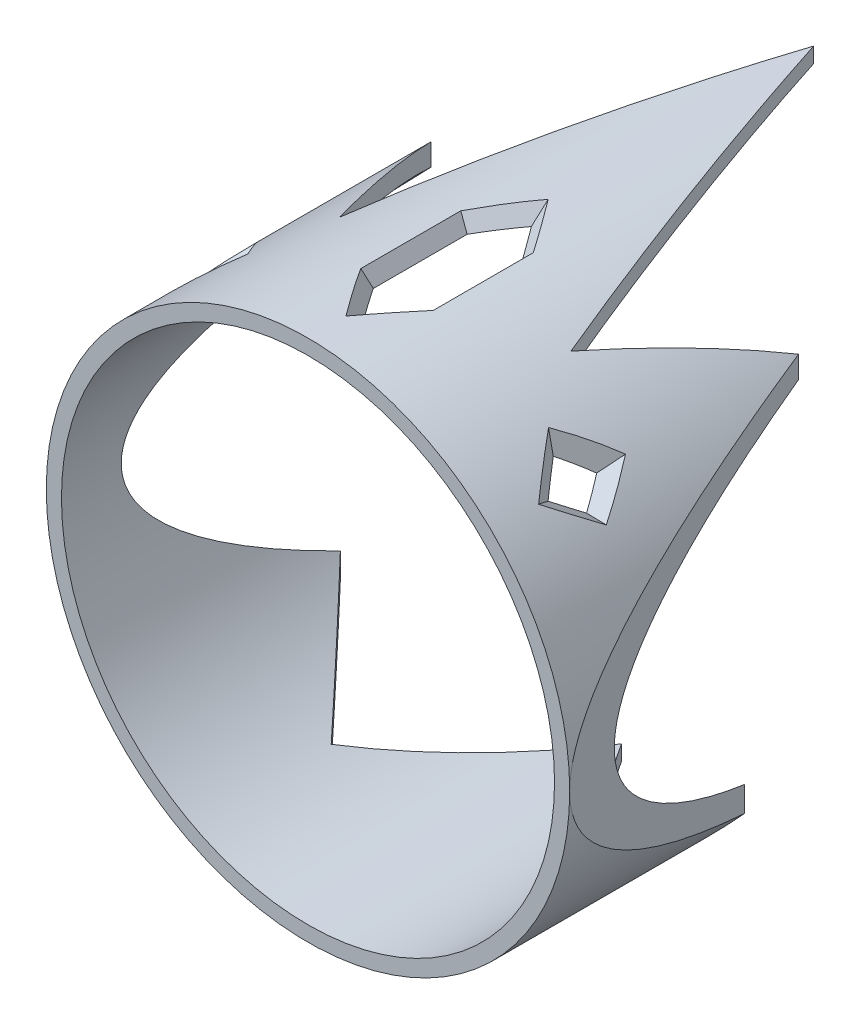
ISO-10303-21;
HEADER;
FILE_DESCRIPTION(('STEP AP214'),'2;1');
FILE_NAME('part.step','',(''),(''),'','','');
FILE_SCHEMA(('AUTOMOTIVE_DESIGN { 1 0 10303 214 1 1 1 1 }'));
ENDSEC;
DATA;
#1=APPLICATION_CONTEXT('core data for automotive mechanical design processes');
#2=APPLICATION_PROTOCOL_DEFINITION('international standard','automotive_design',2000,#1);
#3=PRODUCT_CONTEXT('',#1,'mechanical');
#4=PRODUCT('Part','Part','',(#3));
#5=PRODUCT_RELATED_PRODUCT_CATEGORY('part','',(#4));
#6=PRODUCT_DEFINITION_FORMATION('','',#4);
#7=PRODUCT_DEFINITION_CONTEXT('part definition',#1,'design');
#8=PRODUCT_DEFINITION('design','',#6,#7);
#9=PRODUCT_DEFINITION_SHAPE('','',#8);
#10=(LENGTH_UNIT() NAMED_UNIT(*) SI_UNIT(.MILLI.,.METRE.));
#11=(NAMED_UNIT(*) PLANE_ANGLE_UNIT() SI_UNIT($,.RADIAN.));
#12=(NAMED_UNIT(*) SI_UNIT($,.STERADIAN.) SOLID_ANGLE_UNIT());
#13=UNCERTAINTY_MEASURE_WITH_UNIT(LENGTH_MEASURE(1.E-05),#10,'distance_accuracy_value','');
#14=(GEOMETRIC_REPRESENTATION_CONTEXT(3) GLOBAL_UNCERTAINTY_ASSIGNED_CONTEXT((#13)) GLOBAL_UNIT_ASSIGNED_CONTEXT((#10,
#11,#12)) REPRESENTATION_CONTEXT('',''));
#15=CARTESIAN_POINT('',(0.,0.,0.));
#16=DIRECTION('',(0.,0.,1.));
#17=DIRECTION('',(1.,0.,0.));
#18=AXIS2_PLACEMENT_3D('',#15,#16,#17);
#19=CARTESIAN_POINT('',(0.,0.,200.));
#20=DIRECTION('',(0.,0.,-1.));
#21=DIRECTION('',(-1.,0.,0.));
#22=AXIS2_PLACEMENT_3D('',#19,#20,#21);
#23=CYLINDRICAL_SURFACE('',#22,97.5);
#24=CARTESIAN_POINT('',(0.,0.,60.9712462847032));
#25=DIRECTION('',(-0.016266588786121,-0.848778565505562,0.528498197563231));
#26=DIRECTION('',(-0.0101266512670094,-0.528401169341723,-0.848934423364029));
#27=AXIS2_PLACEMENT_3D('',#24,#25,#26);
#28=ELLIPSE('',#27,184.485018964203,97.5);
#29=CARTESIAN_POINT('',(74.4761351021022,62.9249974195743,164.322330470336));
#30=VERTEX_POINT('',#29);
#31=CARTESIAN_POINT('',(68.8742219493422,69.0115320136624,173.925004817));
#32=VERTEX_POINT('',#31);
#33=EDGE_CURVE('E537',#30,#32,#28,.T.);
#34=ORIENTED_EDGE('',*,*,#33,.F.);
#35=CARTESIAN_POINT('',(0.,0.,267.673414655969));
#36=DIRECTION('',(-0.0162665887861189,-0.848778565505561,-0.528498197563233));
#37=DIRECTION('',(0.0101266512670081,0.528401169341725,-0.848934423364028));
#38=AXIS2_PLACEMENT_3D('',#35,#36,#37);
#39=ELLIPSE('',#38,184.485018964203,97.5);
#40=CARTESIAN_POINT('',(68.8742219493422,69.0115320136624,154.719656123672));
#41=VERTEX_POINT('',#40);
#42=EDGE_CURVE('E547',#41,#30,#39,.T.);
#43=ORIENTED_EDGE('',*,*,#42,.F.);
#44=CARTESIAN_POINT('',(0.,0.,285.831202702026));
#45=DIRECTION('',(-0.830696308797329,-0.175023706174065,-0.528498197563234));
#46=DIRECTION('',(0.517144186687745,0.108959786172042,-0.848934423364027));
#47=AXIS2_PLACEMENT_3D('',#44,#45,#46);
#48=ELLIPSE('',#47,184.485018964203,97.5);
#49=CARTESIAN_POINT('',(61.3368130358151,75.7894805801535,164.322330470336));
#50=VERTEX_POINT('',#49);
#51=EDGE_CURVE('E300',#50,#41,#48,.T.);
#52=ORIENTED_EDGE('',*,*,#51,.F.);
#53=CARTESIAN_POINT('',(0.,0.,42.8134582386467));
#54=DIRECTION('',(-0.830696308797329,-0.175023706174065,0.528498197563234));
#55=DIRECTION('',(-0.517144186687746,-0.108959786172042,-0.848934423364027));
#56=AXIS2_PLACEMENT_3D('',#53,#54,#55);
#57=ELLIPSE('',#56,184.485018964202,97.5);
#58=EDGE_CURVE('E298',#32,#50,#57,.T.);
#59=ORIENTED_EDGE('',*,*,#58,.F.);
#60=EDGE_LOOP('',(#34,#43,#52,#59));
#61=FACE_BOUND('',#60,.T.);
#62=CARTESIAN_POINT('',(0.,0.,70.0000000000003));
#63=DIRECTION('',(0.665640235470275,-0.554700196225228,0.499230176602706));
#64=DIRECTION('',(0.383519245083355,-0.319599370902795,-0.866469405558691));
#65=AXIS2_PLACEMENT_3D('',#62,#63,#64);
#66=ELLIPSE('',#65,195.300694087633,97.5);
#67=CARTESIAN_POINT('',(10.6137203853506,96.9205805780258,163.537906795117));
#68=VERTEX_POINT('',#67);
#69=CARTESIAN_POINT('',(0.,97.5,178.333333333333));
#70=VERTEX_POINT('',#69);
#71=EDGE_CURVE('E439',#68,#70,#66,.T.);
#72=ORIENTED_EDGE('',*,*,#71,.F.);
#73=DIRECTION('',(0.,0.,-1.));
#74=VECTOR('',#73,1.);
#75=CARTESIAN_POINT('',(10.6137203853506,96.9205805780258,200.));
#76=LINE('',#75,#74);
#77=CARTESIAN_POINT('',(10.6137203853506,96.9205805780258,126.462093204883));
#78=VERTEX_POINT('',#77);
#79=EDGE_CURVE('E441',#78,#68,#76,.F.);
#80=ORIENTED_EDGE('',*,*,#79,.F.);
#81=CARTESIAN_POINT('',(0.,0.,220.));
#82=DIRECTION('',(0.665640235470275,-0.554700196225229,-0.499230176602706));
#83=DIRECTION('',(-0.383519245083355,0.319599370902796,-0.866469405558691));
#84=AXIS2_PLACEMENT_3D('',#81,#82,#83);
#85=ELLIPSE('',#84,195.300694087633,97.5);
#86=CARTESIAN_POINT('',(0.,97.5,111.666666666667));
#87=VERTEX_POINT('',#86);
#88=EDGE_CURVE('E459',#87,#78,#85,.T.);
#89=ORIENTED_EDGE('',*,*,#88,.F.);
#90=CARTESIAN_POINT('',(0.,0.,220.));
#91=DIRECTION('',(-0.665640235470275,-0.554700196225229,-0.499230176602706));
#92=DIRECTION('',(0.383519245083355,0.319599370902795,-0.866469405558691));
#93=AXIS2_PLACEMENT_3D('',#90,#91,#92);
#94=ELLIPSE('',#93,195.300694087633,97.5);
#95=CARTESIAN_POINT('',(-10.6137203853505,96.9205805780258,126.462093204883));
#96=VERTEX_POINT('',#95);
#97=EDGE_CURVE('E462',#96,#87,#94,.T.);
#98=ORIENTED_EDGE('',*,*,#97,.F.);
#99=DIRECTION('',(0.,0.,-1.));
#100=VECTOR('',#99,1.);
#101=CARTESIAN_POINT('',(-10.6137203853505,96.9205805780258,200.));
#102=LINE('',#101,#100);
#103=CARTESIAN_POINT('',(-10.6137203853505,96.9205805780258,163.537906795117));
#104=VERTEX_POINT('',#103);
#105=EDGE_CURVE('E485',#104,#96,#102,.T.);
#106=ORIENTED_EDGE('',*,*,#105,.F.);
#107=CARTESIAN_POINT('',(0.,0.,70.0000000000002));
#108=DIRECTION('',(-0.665640235470275,-0.554700196225229,0.499230176602706));
#109=DIRECTION('',(-0.383519245083355,-0.319599370902796,-0.866469405558691));
#110=AXIS2_PLACEMENT_3D('',#107,#108,#109);
#111=ELLIPSE('',#110,195.300694087633,97.5);
#112=EDGE_CURVE('E443',#70,#104,#111,.T.);
#113=ORIENTED_EDGE('',*,*,#112,.F.);
#114=EDGE_LOOP('',(#72,#80,#89,#98,#106,#113));
#115=FACE_BOUND('',#114,.T.);
#116=CARTESIAN_POINT('',(0.,0.,200.));
#117=DIRECTION('',(0.,0.,1.));
#118=DIRECTION('',(1.,0.,0.));
#119=AXIS2_PLACEMENT_3D('',#116,#117,#118);
#120=CIRCLE('',#119,97.5);
#121=CARTESIAN_POINT('',(97.5,0.,200.));
#122=VERTEX_POINT('',#121);
#123=EDGE_CURVE('E373',#122,#122,#120,.T.);
#124=ORIENTED_EDGE('',*,*,#123,.T.);
#125=EDGE_LOOP('',(#124));
#126=FACE_BOUND('',#125,.T.);
#127=CARTESIAN_POINT('',(0.,0.,76.0281927566909));
#128=DIRECTION('',(0.833038620967339,0.,0.553214837090289));
#129=DIRECTION('',(0.553214837090289,0.,-0.833038620967339));
#130=AXIS2_PLACEMENT_3D('',#127,#128,#129);
#131=ELLIPSE('',#130,176.242561592916,97.5);
#132=CARTESIAN_POINT('',(-45.8127871761022,-86.0664773948439,145.013726934657));
#133=VERTEX_POINT('',#132);
#134=CARTESIAN_POINT('',(-6.90750459242112E-13,-97.5,76.0281927566909));
#135=VERTEX_POINT('',#134);
#136=EDGE_CURVE('E348',#133,#135,#131,.T.);
#137=ORIENTED_EDGE('',*,*,#136,.F.);
#138=CARTESIAN_POINT('',(0.,0.,195.690260392621));
#139=DIRECTION('',(0.741808156296973,0.,-0.670612152627199));
#140=DIRECTION('',(-0.670612152627199,0.,-0.741808156296973));
#141=AXIS2_PLACEMENT_3D('',#138,#139,#140);
#142=ELLIPSE('',#141,145.389551349514,97.5);
#143=CARTESIAN_POINT('',(-79.9598109450796,-55.7913849409317,107.241460735992));
#144=VERTEX_POINT('',#143);
#145=EDGE_CURVE('E421',#133,#144,#142,.T.);
#146=ORIENTED_EDGE('',*,*,#145,.T.);
#147=CARTESIAN_POINT('',(0.,0.,-207.834822032485));
#148=DIRECTION('',(-0.969274469650317,0.,-0.24598171168625));
#149=DIRECTION('',(0.24598171168625,0.,-0.969274469650317));
#150=AXIS2_PLACEMENT_3D('',#147,#148,#149);
#151=ELLIPSE('',#150,396.370930715213,97.5);
#152=CARTESIAN_POINT('',(-72.7144819713695,64.9527067306312,78.6917268948368));
#153=VERTEX_POINT('',#152);
#154=EDGE_CURVE('E361',#144,#153,#151,.T.);
#155=ORIENTED_EDGE('',*,*,#154,.T.);
#156=CARTESIAN_POINT('',(0.,0.,249.318778649436));
#157=DIRECTION('',(0.919946215616075,0.,-0.392044589777315));
#158=DIRECTION('',(-0.392044589777315,0.,-0.919946215616075));
#159=AXIS2_PLACEMENT_3D('',#156,#157,#158);
#160=ELLIPSE('',#159,248.696200744362,97.5);
#161=CARTESIAN_POINT('',(-45.8127871761009,86.0664773948445,141.817485968883));
#162=VERTEX_POINT('',#161);
#163=EDGE_CURVE('E363',#153,#162,#160,.T.);
#164=ORIENTED_EDGE('',*,*,#163,.T.);
#165=CARTESIAN_POINT('',(0.,0.,0.));
#166=DIRECTION('',(-0.951580690346734,0.,-0.307399072476207));
#167=DIRECTION('',(0.307399072476207,0.,-0.951580690346734));
#168=AXIS2_PLACEMENT_3D('',#165,#166,#167);
#169=ELLIPSE('',#168,317.177274526573,97.5);
#170=CARTESIAN_POINT('',(0.,97.5,0.));
#171=VERTEX_POINT('',#170);
#172=EDGE_CURVE('E366',#162,#171,#169,.T.);
#173=ORIENTED_EDGE('',*,*,#172,.T.);
#174=CARTESIAN_POINT('',(0.,0.,0.));
#175=DIRECTION('',(-0.951580690346734,0.,0.307399072476207));
#176=DIRECTION('',(-0.307399072476207,0.,-0.951580690346734));
#177=AXIS2_PLACEMENT_3D('',#174,#175,#176);
#178=ELLIPSE('',#177,317.177274526573,97.5);
#179=CARTESIAN_POINT('',(45.8127871761009,86.0664773948445,141.817485968883));
#180=VERTEX_POINT('',#179);
#181=EDGE_CURVE('E400',#180,#171,#178,.T.);
#182=ORIENTED_EDGE('',*,*,#181,.F.);
#183=CARTESIAN_POINT('',(0.,0.,249.318778649436));
#184=DIRECTION('',(0.919946215616075,0.,0.392044589777315));
#185=DIRECTION('',(0.392044589777315,0.,-0.919946215616075));
#186=AXIS2_PLACEMENT_3D('',#183,#184,#185);
#187=ELLIPSE('',#186,248.696200744362,97.5);
#188=CARTESIAN_POINT('',(72.7144819713695,64.9527067306312,78.6917268948368));
#189=VERTEX_POINT('',#188);
#190=EDGE_CURVE('E398',#189,#180,#187,.T.);
#191=ORIENTED_EDGE('',*,*,#190,.F.);
#192=CARTESIAN_POINT('',(0.,0.,-207.834822032485));
#193=DIRECTION('',(0.969274469650317,0.,-0.24598171168625));
#194=DIRECTION('',(-0.24598171168625,0.,-0.969274469650317));
#195=AXIS2_PLACEMENT_3D('',#192,#193,#194);
#196=ELLIPSE('',#195,396.370930715213,97.5);
#197=CARTESIAN_POINT('',(79.9598109450788,-55.7913849409321,107.241460735992));
#198=VERTEX_POINT('',#197);
#199=EDGE_CURVE('E396',#189,#198,#196,.T.);
#200=ORIENTED_EDGE('',*,*,#199,.T.);
#201=CARTESIAN_POINT('',(0.,0.,195.690260392621));
#202=DIRECTION('',(0.741808156296973,0.,0.670612152627199));
#203=DIRECTION('',(0.670612152627199,0.,-0.741808156296973));
#204=AXIS2_PLACEMENT_3D('',#201,#202,#203);
#205=ELLIPSE('',#204,145.389551349514,97.5);
#206=CARTESIAN_POINT('',(45.812787176101,-86.0664773948445,145.013726934657));
#207=VERTEX_POINT('',#206);
#208=EDGE_CURVE('E427',#207,#198,#205,.T.);
#209=ORIENTED_EDGE('',*,*,#208,.F.);
#210=CARTESIAN_POINT('',(0.,0.,76.0281927566909));
#211=DIRECTION('',(0.833038620967339,0.,-0.553214837090289));
#212=DIRECTION('',(-0.553214837090289,0.,-0.833038620967339));
#213=AXIS2_PLACEMENT_3D('',#210,#211,#212);
#214=ELLIPSE('',#213,176.242561592916,97.5);
#215=EDGE_CURVE('E350',#207,#135,#214,.T.);
#216=ORIENTED_EDGE('',*,*,#215,.T.);
#217=EDGE_LOOP('',(#137,#146,#155,#164,#173,#182,#191,#200,#209,#216));
#218=FACE_BOUND('',#217,.T.);
#219=CARTESIAN_POINT('',(0.,0.,42.8134582386459));
#220=DIRECTION('',(-0.83069630879733,0.175023706174066,-0.528498197563232));
#221=DIRECTION('',(0.517144186687744,-0.108959786172042,-0.848934423364028));
#222=AXIS2_PLACEMENT_3D('',#219,#220,#221);
#223=ELLIPSE('',#222,184.485018964203,97.5);
#224=CARTESIAN_POINT('',(-68.8742219493422,69.0115320136623,173.925004817));
#225=VERTEX_POINT('',#224);
#226=CARTESIAN_POINT('',(-61.3368130358151,75.7894805801535,164.322330470336));
#227=VERTEX_POINT('',#226);
#228=EDGE_CURVE('E514',#225,#227,#223,.T.);
#229=ORIENTED_EDGE('',*,*,#228,.T.);
#230=CARTESIAN_POINT('',(0.,0.,285.831202702026));
#231=DIRECTION('',(-0.830696308797329,0.175023706174065,0.528498197563233));
#232=DIRECTION('',(-0.517144186687745,0.108959786172042,-0.848934423364027));
#233=AXIS2_PLACEMENT_3D('',#230,#231,#232);
#234=ELLIPSE('',#233,184.485018964203,97.5);
#235=CARTESIAN_POINT('',(-68.8742219493422,69.0115320136624,154.719656123672));
#236=VERTEX_POINT('',#235);
#237=EDGE_CURVE('E506',#227,#236,#234,.T.);
#238=ORIENTED_EDGE('',*,*,#237,.T.);
#239=CARTESIAN_POINT('',(0.,0.,267.673414655968));
#240=DIRECTION('',(-0.0162665887861182,0.848778565505561,0.528498197563233));
#241=DIRECTION('',(-0.0101266512670077,0.528401169341725,-0.848934423364028));
#242=AXIS2_PLACEMENT_3D('',#239,#240,#241);
#243=ELLIPSE('',#242,184.485018964203,97.5);
#244=CARTESIAN_POINT('',(-74.4761351021022,62.9249974195742,164.322330470336));
#245=VERTEX_POINT('',#244);
#246=EDGE_CURVE('E510',#236,#245,#243,.T.);
#247=ORIENTED_EDGE('',*,*,#246,.T.);
#248=CARTESIAN_POINT('',(0.,0.,60.9712462847037));
#249=DIRECTION('',(-0.0162665887861202,0.848778565505561,-0.528498197563233));
#250=DIRECTION('',(0.0101266512670089,-0.528401169341725,-0.848934423364027));
#251=AXIS2_PLACEMENT_3D('',#248,#249,#250);
#252=ELLIPSE('',#251,184.485018964203,97.5);
#253=EDGE_CURVE('E516',#245,#225,#252,.T.);
#254=ORIENTED_EDGE('',*,*,#253,.T.);
#255=EDGE_LOOP('',(#229,#238,#247,#254));
#256=FACE_BOUND('',#255,.T.);
#257=ADVANCED_FACE('F121',(#61,#115,#126,#218,#256),#23,.F.);
#258=CARTESIAN_POINT('',(0.,0.,200.));
#259=DIRECTION('',(0.,0.,-1.));
#260=DIRECTION('',(-1.,0.,0.));
#261=AXIS2_PLACEMENT_3D('',#258,#259,#260);
#262=CYLINDRICAL_SURFACE('',#261,103.5);
#263=CARTESIAN_POINT('',(0.,0.,267.673414655969));
#264=DIRECTION('',(-0.0162665887861189,-0.848778565505561,-0.528498197563233));
#265=DIRECTION('',(0.0101266512670081,0.528401169341725,-0.848934423364028));
#266=AXIS2_PLACEMENT_3D('',#263,#264,#265);
#267=ELLIPSE('',#266,195.837943208154,103.5);
#268=CARTESIAN_POINT('',(72.7144819713695,73.6536089518727,147.146189736));
#269=VERTEX_POINT('',#268);
#270=CARTESIAN_POINT('',(82.2892246632802,62.7752618817015,164.322330470336));
#271=VERTEX_POINT('',#270);
#272=EDGE_CURVE('E290',#269,#271,#267,.T.);
#273=ORIENTED_EDGE('',*,*,#272,.T.);
#274=CARTESIAN_POINT('',(0.,0.,60.9712462847032));
#275=DIRECTION('',(-0.016266588786121,-0.848778565505562,0.528498197563231));
#276=DIRECTION('',(-0.0101266512670094,-0.528401169341723,-0.848934423364029));
#277=AXIS2_PLACEMENT_3D('',#274,#275,#276);
#278=ELLIPSE('',#277,195.837943208154,103.5);
#279=CARTESIAN_POINT('',(72.7144819713695,73.6536089518727,181.498471204673));
#280=VERTEX_POINT('',#279);
#281=EDGE_CURVE('E12',#271,#280,#278,.T.);
#282=ORIENTED_EDGE('',*,*,#281,.T.);
#283=CARTESIAN_POINT('',(0.,0.,42.8134582386467));
#284=DIRECTION('',(-0.830696308797329,-0.175023706174065,0.528498197563234));
#285=DIRECTION('',(-0.517144186687746,-0.108959786172042,-0.848934423364027));
#286=AXIS2_PLACEMENT_3D('',#283,#284,#285);
#287=ELLIPSE('',#286,195.837943208153,103.5);
#288=CARTESIAN_POINT('',(59.45541264104,84.71897017601,164.322330470336));
#289=VERTEX_POINT('',#288);
#290=EDGE_CURVE('E129',#280,#289,#287,.T.);
#291=ORIENTED_EDGE('',*,*,#290,.T.);
#292=CARTESIAN_POINT('',(0.,0.,285.831202702026));
#293=DIRECTION('',(-0.830696308797329,-0.175023706174065,-0.528498197563234));
#294=DIRECTION('',(0.517144186687745,0.108959786172042,-0.848934423364027));
#295=AXIS2_PLACEMENT_3D('',#292,#293,#294);
#296=ELLIPSE('',#295,195.837943208153,103.5);
#297=EDGE_CURVE('E285',#289,#269,#296,.T.);
#298=ORIENTED_EDGE('',*,*,#297,.T.);
#299=EDGE_LOOP('',(#273,#282,#291,#298));
#300=FACE_BOUND('',#299,.T.);
#301=DIRECTION('',(0.,0.,-1.));
#302=VECTOR('',#301,1.);
#303=CARTESIAN_POINT('',(14.3349859263317,102.502478889497,200.));
#304=LINE('',#303,#302);
#305=CARTESIAN_POINT('',(14.3349859263317,102.502478889497,125.22167135789));
#306=VERTEX_POINT('',#305);
#307=CARTESIAN_POINT('',(14.3349859263317,102.502478889497,164.778328642111));
#308=VERTEX_POINT('',#307);
#309=EDGE_CURVE('E327',#306,#308,#304,.F.);
#310=ORIENTED_EDGE('',*,*,#309,.T.);
#311=CARTESIAN_POINT('',(0.,0.,70.0000000000003));
#312=DIRECTION('',(0.665640235470275,-0.554700196225228,0.499230176602706));
#313=DIRECTION('',(0.383519245083355,-0.319599370902795,-0.866469405558691));
#314=AXIS2_PLACEMENT_3D('',#311,#312,#313);
#315=ELLIPSE('',#314,207.319198339179,103.5);
#316=CARTESIAN_POINT('',(0.,103.5,185.));
#317=VERTEX_POINT('',#316);
#318=EDGE_CURVE('E322',#308,#317,#315,.T.);
#319=ORIENTED_EDGE('',*,*,#318,.T.);
#320=CARTESIAN_POINT('',(0.,0.,70.0000000000002));
#321=DIRECTION('',(-0.665640235470275,-0.554700196225229,0.499230176602706));
#322=DIRECTION('',(-0.383519245083355,-0.319599370902796,-0.866469405558691));
#323=AXIS2_PLACEMENT_3D('',#320,#321,#322);
#324=ELLIPSE('',#323,207.319198339179,103.5);
#325=CARTESIAN_POINT('',(-14.3349859263316,102.502478889497,164.778328642111));
#326=VERTEX_POINT('',#325);
#327=EDGE_CURVE('E330',#317,#326,#324,.T.);
#328=ORIENTED_EDGE('',*,*,#327,.T.);
#329=DIRECTION('',(0.,0.,-1.));
#330=VECTOR('',#329,1.);
#331=CARTESIAN_POINT('',(-14.3349859263316,102.502478889497,200.));
#332=LINE('',#331,#330);
#333=CARTESIAN_POINT('',(-14.3349859263316,102.502478889497,125.22167135789));
#334=VERTEX_POINT('',#333);
#335=EDGE_CURVE('E335',#326,#334,#332,.T.);
#336=ORIENTED_EDGE('',*,*,#335,.T.);
#337=CARTESIAN_POINT('',(0.,0.,220.));
#338=DIRECTION('',(-0.665640235470275,-0.554700196225229,-0.499230176602706));
#339=DIRECTION('',(0.383519245083355,0.319599370902795,-0.866469405558691));
#340=AXIS2_PLACEMENT_3D('',#337,#338,#339);
#341=ELLIPSE('',#340,207.31919833918,103.5);
#342=CARTESIAN_POINT('',(0.,103.5,105.));
#343=VERTEX_POINT('',#342);
#344=EDGE_CURVE('E338',#334,#343,#341,.T.);
#345=ORIENTED_EDGE('',*,*,#344,.T.);
#346=CARTESIAN_POINT('',(0.,0.,220.));
#347=DIRECTION('',(0.665640235470275,-0.554700196225229,-0.499230176602706));
#348=DIRECTION('',(-0.383519245083355,0.319599370902796,-0.866469405558691));
#349=AXIS2_PLACEMENT_3D('',#346,#347,#348);
#350=ELLIPSE('',#349,207.319198339179,103.5);
#351=EDGE_CURVE('E343',#343,#306,#350,.T.);
#352=ORIENTED_EDGE('',*,*,#351,.T.);
#353=EDGE_LOOP('',(#310,#319,#328,#336,#345,#352));
#354=FACE_BOUND('',#353,.T.);
#355=CARTESIAN_POINT('',(0.,0.,200.));
#356=DIRECTION('',(0.,0.,1.));
#357=DIRECTION('',(1.,0.,0.));
#358=AXIS2_PLACEMENT_3D('',#355,#356,#357);
#359=CIRCLE('',#358,103.5);
#360=CARTESIAN_POINT('',(103.5,0.,200.));
#361=VERTEX_POINT('',#360);
#362=CARTESIAN_POINT('',(-103.5,0.,200.));
#363=VERTEX_POINT('',#362);
#364=EDGE_CURVE('E372',#361,#363,#359,.T.);
#365=ORIENTED_EDGE('',*,*,#364,.F.);
#366=CARTESIAN_POINT('',(0.,0.,-207.834822032485));
#367=DIRECTION('',(-0.969274469650317,0.,0.24598171168625));
#368=DIRECTION('',(-0.24598171168625,0.,-0.969274469650317));
#369=AXIS2_PLACEMENT_3D('',#366,#367,#368);
#370=ELLIPSE('',#369,420.762987989995,103.5);
#371=CARTESIAN_POINT('',(72.7144819713695,73.6536089518727,78.6917268948368));
#372=VERTEX_POINT('',#371);
#373=EDGE_CURVE('E405',#361,#372,#370,.T.);
#374=ORIENTED_EDGE('',*,*,#373,.T.);
#375=CARTESIAN_POINT('',(0.,0.,249.318778649436));
#376=DIRECTION('',(0.919946215616075,0.,0.392044589777315));
#377=DIRECTION('',(0.392044589777315,0.,-0.919946215616075));
#378=AXIS2_PLACEMENT_3D('',#375,#376,#377);
#379=ELLIPSE('',#378,264.00058232863,103.5);
#380=CARTESIAN_POINT('',(45.8127871761009,92.8086123759928,141.817485968883));
#381=VERTEX_POINT('',#380);
#382=EDGE_CURVE('E358',#372,#381,#379,.T.);
#383=ORIENTED_EDGE('',*,*,#382,.T.);
#384=CARTESIAN_POINT('',(0.,0.,0.));
#385=DIRECTION('',(-0.951580690346734,0.,0.307399072476207));
#386=DIRECTION('',(-0.307399072476207,0.,-0.951580690346734));
#387=AXIS2_PLACEMENT_3D('',#384,#385,#386);
#388=ELLIPSE('',#387,336.695876035901,103.5);
#389=CARTESIAN_POINT('',(0.,103.5,0.));
#390=VERTEX_POINT('',#389);
#391=EDGE_CURVE('E402',#381,#390,#388,.T.);
#392=ORIENTED_EDGE('',*,*,#391,.T.);
#393=CARTESIAN_POINT('',(0.,0.,0.));
#394=DIRECTION('',(-0.951580690346734,0.,-0.307399072476207));
#395=DIRECTION('',(0.307399072476207,0.,-0.951580690346734));
#396=AXIS2_PLACEMENT_3D('',#393,#394,#395);
#397=ELLIPSE('',#396,336.695876035901,103.5);
#398=CARTESIAN_POINT('',(-45.8127871761009,92.8086123759928,141.817485968883));
#399=VERTEX_POINT('',#398);
#400=EDGE_CURVE('E381',#399,#390,#397,.T.);
#401=ORIENTED_EDGE('',*,*,#400,.F.);
#402=CARTESIAN_POINT('',(0.,0.,249.318778649436));
#403=DIRECTION('',(0.919946215616075,0.,-0.392044589777315));
#404=DIRECTION('',(-0.392044589777315,0.,-0.919946215616075));
#405=AXIS2_PLACEMENT_3D('',#402,#403,#404);
#406=ELLIPSE('',#405,264.00058232863,103.5);
#407=CARTESIAN_POINT('',(-72.7144819713695,73.6536089518727,78.6917268948368));
#408=VERTEX_POINT('',#407);
#409=EDGE_CURVE('E379',#408,#399,#406,.T.);
#410=ORIENTED_EDGE('',*,*,#409,.F.);
#411=CARTESIAN_POINT('',(0.,0.,-207.834822032485));
#412=DIRECTION('',(-0.969274469650317,0.,-0.24598171168625));
#413=DIRECTION('',(0.24598171168625,0.,-0.969274469650317));
#414=AXIS2_PLACEMENT_3D('',#411,#412,#413);
#415=ELLIPSE('',#414,420.762987989995,103.5);
#416=EDGE_CURVE('E377',#363,#408,#415,.T.);
#417=ORIENTED_EDGE('',*,*,#416,.F.);
#418=EDGE_LOOP('',(#365,#374,#383,#392,#401,#410,#417));
#419=FACE_BOUND('',#418,.T.);
#420=CARTESIAN_POINT('',(0.,0.,285.831202702026));
#421=DIRECTION('',(-0.830696308797329,0.175023706174065,0.528498197563233));
#422=DIRECTION('',(-0.517144186687745,0.108959786172042,-0.848934423364027));
#423=AXIS2_PLACEMENT_3D('',#420,#421,#422);
#424=ELLIPSE('',#423,195.837943208154,103.5);
#425=CARTESIAN_POINT('',(-59.45541264104,84.71897017601,164.322330470336));
#426=VERTEX_POINT('',#425);
#427=CARTESIAN_POINT('',(-72.7144819713695,73.6536089518727,147.146189735999));
#428=VERTEX_POINT('',#427);
#429=EDGE_CURVE('E291',#426,#428,#424,.T.);
#430=ORIENTED_EDGE('',*,*,#429,.F.);
#431=CARTESIAN_POINT('',(0.,0.,42.8134582386459));
#432=DIRECTION('',(-0.83069630879733,0.175023706174066,-0.528498197563232));
#433=DIRECTION('',(0.517144186687744,-0.108959786172042,-0.848934423364028));
#434=AXIS2_PLACEMENT_3D('',#431,#432,#433);
#435=ELLIPSE('',#434,195.837943208154,103.5);
#436=CARTESIAN_POINT('',(-72.7144819713695,73.6536089518727,181.498471204673));
#437=VERTEX_POINT('',#436);
#438=EDGE_CURVE('E315',#437,#426,#435,.T.);
#439=ORIENTED_EDGE('',*,*,#438,.F.);
#440=CARTESIAN_POINT('',(0.,0.,60.9712462847037));
#441=DIRECTION('',(-0.0162665887861202,0.848778565505561,-0.528498197563233));
#442=DIRECTION('',(0.0101266512670089,-0.528401169341725,-0.848934423364027));
#443=AXIS2_PLACEMENT_3D('',#440,#441,#442);
#444=ELLIPSE('',#443,195.837943208154,103.5);
#445=CARTESIAN_POINT('',(-82.2892246632802,62.7752618817015,164.322330470336));
#446=VERTEX_POINT('',#445);
#447=EDGE_CURVE('E320',#446,#437,#444,.T.);
#448=ORIENTED_EDGE('',*,*,#447,.F.);
#449=CARTESIAN_POINT('',(0.,0.,267.673414655968));
#450=DIRECTION('',(-0.0162665887861182,0.848778565505561,0.528498197563233));
#451=DIRECTION('',(-0.0101266512670077,0.528401169341725,-0.848934423364028));
#452=AXIS2_PLACEMENT_3D('',#449,#450,#451);
#453=ELLIPSE('',#452,195.837943208154,103.5);
#454=EDGE_CURVE('E312',#428,#446,#453,.T.);
#455=ORIENTED_EDGE('',*,*,#454,.F.);
#456=EDGE_LOOP('',(#430,#439,#448,#455));
#457=FACE_BOUND('',#456,.T.);
#458=ADVANCED_FACE('F123',(#300,#354,#419,#457),#262,.T.);
#459=CARTESIAN_POINT('',(0.,0.,195.690260392621));
#460=DIRECTION('',(0.741808156296973,0.,-0.670612152627199));
#461=DIRECTION('',(-0.670612152627199,0.,-0.741808156296973));
#462=AXIS2_PLACEMENT_3D('',#459,#460,#461);
#463=ELLIPSE('',#462,154.33660066333,103.5);
#464=CARTESIAN_POINT('',(-45.8127871761022,-92.8086123759922,145.013726934657));
#465=VERTEX_POINT('',#464);
#466=CARTESIAN_POINT('',(-79.9598109450797,-65.7166541572776,107.241460735992));
#467=VERTEX_POINT('',#466);
#468=EDGE_CURVE('E419',#465,#467,#463,.T.);
#469=ORIENTED_EDGE('',*,*,#468,.F.);
#470=CARTESIAN_POINT('',(0.,0.,76.0281927566909));
#471=DIRECTION('',(0.833038620967339,0.,0.553214837090289));
#472=DIRECTION('',(0.553214837090289,0.,-0.833038620967339));
#473=AXIS2_PLACEMENT_3D('',#470,#471,#472);
#474=ELLIPSE('',#473,187.088257690941,103.5);
#475=CARTESIAN_POINT('',(-7.3264823530823E-13,-103.5,76.0281927566909));
#476=VERTEX_POINT('',#475);
#477=EDGE_CURVE('E416',#465,#476,#474,.T.);
#478=ORIENTED_EDGE('',*,*,#477,.T.);
#479=CARTESIAN_POINT('',(0.,0.,76.0281927566909));
#480=DIRECTION('',(0.833038620967339,0.,-0.553214837090289));
#481=DIRECTION('',(-0.553214837090289,0.,-0.833038620967339));
#482=AXIS2_PLACEMENT_3D('',#479,#480,#481);
#483=ELLIPSE('',#482,187.088257690941,103.5);
#484=CARTESIAN_POINT('',(45.8127871761009,-92.8086123759928,145.013726934657));
#485=VERTEX_POINT('',#484);
#486=EDGE_CURVE('E414',#485,#476,#483,.T.);
#487=ORIENTED_EDGE('',*,*,#486,.F.);
#488=CARTESIAN_POINT('',(0.,0.,195.690260392621));
#489=DIRECTION('',(0.741808156296973,0.,0.670612152627199));
#490=DIRECTION('',(0.670612152627199,0.,-0.741808156296973));
#491=AXIS2_PLACEMENT_3D('',#488,#489,#490);
#492=ELLIPSE('',#491,154.33660066333,103.5);
#493=CARTESIAN_POINT('',(79.9598109450787,-65.7166541572779,107.241460735992));
#494=VERTEX_POINT('',#493);
#495=EDGE_CURVE('E424',#485,#494,#492,.T.);
#496=ORIENTED_EDGE('',*,*,#495,.T.);
#497=CARTESIAN_POINT('',(0.,0.,-207.834822032485));
#498=DIRECTION('',(0.969274469650317,0.,-0.24598171168625));
#499=DIRECTION('',(-0.24598171168625,0.,-0.969274469650317));
#500=AXIS2_PLACEMENT_3D('',#497,#498,#499);
#501=ELLIPSE('',#500,420.762987989995,103.5);
#502=EDGE_CURVE('E393',#361,#494,#501,.T.);
#503=ORIENTED_EDGE('',*,*,#502,.F.);
#504=EDGE_CURVE('E369',#363,#361,#359,.T.);
#505=ORIENTED_EDGE('',*,*,#504,.F.);
#506=EDGE_CURVE('E376',#467,#363,#415,.T.);
#507=ORIENTED_EDGE('',*,*,#506,.F.);
#508=EDGE_LOOP('',(#469,#478,#487,#496,#503,#505,#507));
#509=FACE_BOUND('',#508,.T.);
#510=ADVANCED_FACE('F573',(#509),#262,.T.);
#511=CARTESIAN_POINT('',(-49.5527666152225,150.,-12.5754620930015));
#512=DIRECTION('',(-0.969274469650317,0.,-0.24598171168625));
#513=DIRECTION('',(-0.24598171168625,0.,0.969274469650317));
#514=AXIS2_PLACEMENT_3D('',#511,#512,#513);
#515=PLANE('',#514);
#516=DIRECTION('',(0.,-1.,0.));
#517=VECTOR('',#516,1.);
#518=CARTESIAN_POINT('',(-72.7144819713695,150.,78.6917268948368));
#519=LINE('',#518,#517);
#520=EDGE_CURVE('E384',#408,#153,#519,.T.);
#521=ORIENTED_EDGE('',*,*,#520,.T.);
#522=ORIENTED_EDGE('',*,*,#154,.F.);
#523=DIRECTION('',(0.,-1.,0.));
#524=VECTOR('',#523,1.);
#525=CARTESIAN_POINT('',(-79.9598109450786,150.000000000001,107.241460735991));
#526=LINE('',#525,#524);
#527=EDGE_CURVE('E353',#144,#467,#526,.T.);
#528=ORIENTED_EDGE('',*,*,#527,.T.);
#529=ORIENTED_EDGE('',*,*,#506,.T.);
#530=ORIENTED_EDGE('',*,*,#416,.T.);
#531=EDGE_LOOP('',(#521,#522,#528,#529,#530));
#532=FACE_BOUND('',#531,.T.);
#533=ADVANCED_FACE('F575',(#532),#515,.T.);
#534=CARTESIAN_POINT('',(0.,0.,200.));
#535=DIRECTION('',(0.,0.,1.));
#536=DIRECTION('',(1.,0.,0.));
#537=AXIS2_PLACEMENT_3D('',#534,#535,#536);
#538=PLANE('',#537);
#539=ORIENTED_EDGE('',*,*,#504,.T.);
#540=ORIENTED_EDGE('',*,*,#364,.T.);
#541=EDGE_LOOP('',(#539,#540));
#542=FACE_BOUND('',#541,.T.);
#543=ORIENTED_EDGE('',*,*,#123,.F.);
#544=EDGE_LOOP('',(#543));
#545=FACE_BOUND('',#544,.T.);
#546=ADVANCED_FACE('F577',(#542,#545),#538,.T.);
#547=CARTESIAN_POINT('',(-89.9192949304138,150.,38.3200370800498));
#548=DIRECTION('',(0.919946215616075,0.,-0.392044589777315));
#549=DIRECTION('',(-0.392044589777315,0.,-0.919946215616075));
#550=AXIS2_PLACEMENT_3D('',#547,#548,#549);
#551=PLANE('',#550);
#552=ORIENTED_EDGE('',*,*,#409,.T.);
#553=DIRECTION('',(0.,-1.,0.));
#554=VECTOR('',#553,1.);
#555=CARTESIAN_POINT('',(-45.8127871761009,150.,141.817485968883));
#556=LINE('',#555,#554);
#557=EDGE_CURVE('E387',#399,#162,#556,.T.);
#558=ORIENTED_EDGE('',*,*,#557,.T.);
#559=ORIENTED_EDGE('',*,*,#163,.F.);
#560=ORIENTED_EDGE('',*,*,#520,.F.);
#561=EDGE_LOOP('',(#552,#558,#559,#560));
#562=FACE_BOUND('',#561,.T.);
#563=ADVANCED_FACE('F579',(#562),#551,.T.);
#564=CARTESIAN_POINT('',(0.,150.,0.));
#565=DIRECTION('',(-0.951580690346734,0.,-0.307399072476207));
#566=DIRECTION('',(-0.307399072476207,0.,0.951580690346734));
#567=AXIS2_PLACEMENT_3D('',#564,#565,#566);
#568=PLANE('',#567);
#569=ORIENTED_EDGE('',*,*,#400,.T.);
#570=DIRECTION('',(0.,-1.,0.));
#571=VECTOR('',#570,1.);
#572=CARTESIAN_POINT('',(0.,150.,0.));
#573=LINE('',#572,#571);
#574=EDGE_CURVE('E390',#390,#171,#573,.T.);
#575=ORIENTED_EDGE('',*,*,#574,.T.);
#576=ORIENTED_EDGE('',*,*,#172,.F.);
#577=ORIENTED_EDGE('',*,*,#557,.F.);
#578=EDGE_LOOP('',(#569,#575,#576,#577));
#579=FACE_BOUND('',#578,.T.);
#580=ADVANCED_FACE('F585',(#579),#568,.T.);
#581=CARTESIAN_POINT('',(49.5527666152225,-150.,-12.5754620930015));
#582=DIRECTION('',(0.969274469650317,0.,-0.24598171168625));
#583=DIRECTION('',(-0.24598171168625,0.,-0.969274469650317));
#584=AXIS2_PLACEMENT_3D('',#581,#582,#583);
#585=PLANE('',#584);
#586=DIRECTION('',(0.,-1.,0.));
#587=VECTOR('',#586,1.);
#588=CARTESIAN_POINT('',(79.9598109450786,-150.000000000001,107.241460735991));
#589=LINE('',#588,#587);
#590=EDGE_CURVE('E356',#198,#494,#589,.T.);
#591=ORIENTED_EDGE('',*,*,#590,.F.);
#592=ORIENTED_EDGE('',*,*,#199,.F.);
#593=DIRECTION('',(0.,-1.,0.));
#594=VECTOR('',#593,1.);
#595=CARTESIAN_POINT('',(72.7144819713695,150.,78.6917268948368));
#596=LINE('',#595,#594);
#597=EDGE_CURVE('E411',#372,#189,#596,.T.);
#598=ORIENTED_EDGE('',*,*,#597,.F.);
#599=ORIENTED_EDGE('',*,*,#373,.F.);
#600=ORIENTED_EDGE('',*,*,#502,.T.);
#601=EDGE_LOOP('',(#591,#592,#598,#599,#600));
#602=FACE_BOUND('',#601,.T.);
#603=ADVANCED_FACE('F651',(#602),#585,.T.);
#604=CARTESIAN_POINT('',(89.9192949304138,150.,38.3200370800498));
#605=DIRECTION('',(0.919946215616075,0.,0.392044589777315));
#606=DIRECTION('',(0.392044589777315,0.,-0.919946215616075));
#607=AXIS2_PLACEMENT_3D('',#604,#605,#606);
#608=PLANE('',#607);
#609=ORIENTED_EDGE('',*,*,#190,.T.);
#610=DIRECTION('',(0.,-1.,0.));
#611=VECTOR('',#610,1.);
#612=CARTESIAN_POINT('',(45.8127871761009,150.,141.817485968883));
#613=LINE('',#612,#611);
#614=EDGE_CURVE('E408',#381,#180,#613,.T.);
#615=ORIENTED_EDGE('',*,*,#614,.F.);
#616=ORIENTED_EDGE('',*,*,#382,.F.);
#617=ORIENTED_EDGE('',*,*,#597,.T.);
#618=EDGE_LOOP('',(#609,#615,#616,#617));
#619=FACE_BOUND('',#618,.T.);
#620=ADVANCED_FACE('F648',(#619),#608,.F.);
#621=CARTESIAN_POINT('',(0.,150.,0.));
#622=DIRECTION('',(-0.951580690346734,0.,0.307399072476207));
#623=DIRECTION('',(0.307399072476207,0.,0.951580690346734));
#624=AXIS2_PLACEMENT_3D('',#621,#622,#623);
#625=PLANE('',#624);
#626=ORIENTED_EDGE('',*,*,#181,.T.);
#627=ORIENTED_EDGE('',*,*,#574,.F.);
#628=ORIENTED_EDGE('',*,*,#391,.F.);
#629=ORIENTED_EDGE('',*,*,#614,.T.);
#630=EDGE_LOOP('',(#626,#627,#628,#629));
#631=FACE_BOUND('',#630,.T.);
#632=ADVANCED_FACE('F646',(#631),#625,.F.);
#633=CARTESIAN_POINT('',(-35.0375413120071,-110.,23.2681741531474));
#634=DIRECTION('',(0.833038620967339,0.,-0.553214837090289));
#635=DIRECTION('',(-0.553214837090289,0.,-0.833038620967339));
#636=AXIS2_PLACEMENT_3D('',#633,#634,#635);
#637=PLANE('',#636);
#638=ORIENTED_EDGE('',*,*,#486,.T.);
#639=DIRECTION('',(0.,1.,0.));
#640=VECTOR('',#639,1.);
#641=CARTESIAN_POINT('',(-7.7803749271319E-13,-110.,76.0281927566909));
#642=LINE('',#641,#640);
#643=EDGE_CURVE('E430',#476,#135,#642,.T.);
#644=ORIENTED_EDGE('',*,*,#643,.T.);
#645=ORIENTED_EDGE('',*,*,#215,.F.);
#646=DIRECTION('',(0.,1.,0.));
#647=VECTOR('',#646,1.);
#648=CARTESIAN_POINT('',(45.8127871761008,-110.,145.013726934657));
#649=LINE('',#648,#647);
#650=EDGE_CURVE('E436',#485,#207,#649,.T.);
#651=ORIENTED_EDGE('',*,*,#650,.F.);
#652=EDGE_LOOP('',(#638,#644,#645,#651));
#653=FACE_BOUND('',#652,.T.);
#654=ADVANCED_FACE('F642',(#653),#637,.T.);
#655=CARTESIAN_POINT('',(35.0375413120055,-110.,23.2681741531474));
#656=DIRECTION('',(0.833038620967339,0.,0.553214837090289));
#657=DIRECTION('',(0.553214837090289,0.,-0.833038620967339));
#658=AXIS2_PLACEMENT_3D('',#655,#656,#657);
#659=PLANE('',#658);
#660=DIRECTION('',(0.,1.,0.));
#661=VECTOR('',#660,1.);
#662=CARTESIAN_POINT('',(-45.8127871761023,-110.,145.013726934657));
#663=LINE('',#662,#661);
#664=EDGE_CURVE('E433',#465,#133,#663,.T.);
#665=ORIENTED_EDGE('',*,*,#664,.T.);
#666=ORIENTED_EDGE('',*,*,#136,.T.);
#667=ORIENTED_EDGE('',*,*,#643,.F.);
#668=ORIENTED_EDGE('',*,*,#477,.F.);
#669=EDGE_LOOP('',(#665,#666,#667,#668));
#670=FACE_BOUND('',#669,.T.);
#671=ADVANCED_FACE('F638',(#670),#659,.F.);
#672=CARTESIAN_POINT('',(-97.3491658593807,-109.999999999999,88.0059529128251));
#673=DIRECTION('',(0.741808156296973,0.,-0.670612152627199));
#674=DIRECTION('',(-0.670612152627199,0.,-0.741808156296973));
#675=AXIS2_PLACEMENT_3D('',#672,#673,#674);
#676=PLANE('',#675);
#677=ORIENTED_EDGE('',*,*,#468,.T.);
#678=ORIENTED_EDGE('',*,*,#527,.F.);
#679=ORIENTED_EDGE('',*,*,#145,.F.);
#680=ORIENTED_EDGE('',*,*,#664,.F.);
#681=EDGE_LOOP('',(#677,#678,#679,#680));
#682=FACE_BOUND('',#681,.T.);
#683=ADVANCED_FACE('F634',(#682),#676,.T.);
#684=CARTESIAN_POINT('',(97.3491658593791,-110.000000000001,88.0059529128251));
#685=DIRECTION('',(0.741808156296973,0.,0.670612152627199));
#686=DIRECTION('',(0.670612152627199,0.,-0.741808156296973));
#687=AXIS2_PLACEMENT_3D('',#684,#685,#686);
#688=PLANE('',#687);
#689=ORIENTED_EDGE('',*,*,#650,.T.);
#690=ORIENTED_EDGE('',*,*,#208,.T.);
#691=ORIENTED_EDGE('',*,*,#590,.T.);
#692=ORIENTED_EDGE('',*,*,#495,.F.);
#693=EDGE_LOOP('',(#689,#690,#691,#692));
#694=FACE_BOUND('',#693,.T.);
#695=ADVANCED_FACE('F620',(#694),#688,.F.);
#696=CARTESIAN_POINT('',(23.2615384615386,-19.3846153846155,17.4461538461539));
#697=DIRECTION('',(0.665640235470275,-0.554700196225228,0.499230176602706));
#698=DIRECTION('',(0.640184399664479,0.768221279597376,0.));
#699=AXIS2_PLACEMENT_3D('',#696,#697,#698);
#700=PLANE('',#699);
#701=ORIENTED_EDGE('',*,*,#71,.T.);
#702=DIRECTION('',(0.,-0.66896473162245,-0.743294146247166));
#703=VECTOR('',#702,1.);
#704=CARTESIAN_POINT('',(0.,103.5,185.));
#705=LINE('',#704,#703);
#706=EDGE_CURVE('E449',#317,#70,#705,.T.);
#707=ORIENTED_EDGE('',*,*,#706,.F.);
#708=ORIENTED_EDGE('',*,*,#318,.F.);
#709=DIRECTION('',(-0.545454545454545,-0.818181818181818,-0.181818181818182));
#710=VECTOR('',#709,1.);
#711=CARTESIAN_POINT('',(15.,103.5,165.));
#712=LINE('',#711,#710);
#713=EDGE_CURVE('E444',#308,#68,#712,.T.);
#714=ORIENTED_EDGE('',*,*,#713,.T.);
#715=EDGE_LOOP('',(#701,#707,#708,#714));
#716=FACE_BOUND('',#715,.T.);
#717=ADVANCED_FACE('F495',(#716),#700,.F.);
#718=CARTESIAN_POINT('',(-37.3846153846154,24.9230769230769,0.));
#719=DIRECTION('',(0.832050294337844,-0.554700196225229,0.));
#720=DIRECTION('',(0.554700196225229,0.832050294337844,0.));
#721=AXIS2_PLACEMENT_3D('',#718,#719,#720);
#722=PLANE('',#721);
#723=ORIENTED_EDGE('',*,*,#79,.T.);
#724=ORIENTED_EDGE('',*,*,#713,.F.);
#725=ORIENTED_EDGE('',*,*,#309,.F.);
#726=DIRECTION('',(-0.545454545454546,-0.818181818181818,0.181818181818182));
#727=VECTOR('',#726,1.);
#728=CARTESIAN_POINT('',(15.,103.5,125.));
#729=LINE('',#728,#727);
#730=EDGE_CURVE('E456',#306,#78,#729,.T.);
#731=ORIENTED_EDGE('',*,*,#730,.T.);
#732=EDGE_LOOP('',(#723,#724,#725,#731));
#733=FACE_BOUND('',#732,.T.);
#734=ADVANCED_FACE('F492',(#733),#722,.F.);
#735=CARTESIAN_POINT('',(-23.2615384615385,-19.3846153846154,17.4461538461539));
#736=DIRECTION('',(-0.665640235470275,-0.554700196225229,0.499230176602706));
#737=DIRECTION('',(0.64018439966448,-0.768221279597376,0.));
#738=AXIS2_PLACEMENT_3D('',#735,#736,#737);
#739=PLANE('',#738);
#740=ORIENTED_EDGE('',*,*,#112,.T.);
#741=DIRECTION('',(0.545454545454545,-0.818181818181818,-0.181818181818182));
#742=VECTOR('',#741,1.);
#743=CARTESIAN_POINT('',(-15.,103.5,165.));
#744=LINE('',#743,#742);
#745=EDGE_CURVE('E448',#326,#104,#744,.T.);
#746=ORIENTED_EDGE('',*,*,#745,.F.);
#747=ORIENTED_EDGE('',*,*,#327,.F.);
#748=ORIENTED_EDGE('',*,*,#706,.T.);
#749=EDGE_LOOP('',(#740,#746,#747,#748));
#750=FACE_BOUND('',#749,.T.);
#751=ADVANCED_FACE('F623',(#750),#739,.F.);
#752=CARTESIAN_POINT('',(37.3846153846154,24.923076923077,0.));
#753=DIRECTION('',(-0.832050294337844,-0.554700196225229,0.));
#754=DIRECTION('',(0.554700196225229,-0.832050294337844,0.));
#755=AXIS2_PLACEMENT_3D('',#752,#753,#754);
#756=PLANE('',#755);
#757=ORIENTED_EDGE('',*,*,#105,.T.);
#758=DIRECTION('',(0.545454545454546,-0.818181818181818,0.181818181818182));
#759=VECTOR('',#758,1.);
#760=CARTESIAN_POINT('',(-15.,103.5,125.));
#761=LINE('',#760,#759);
#762=EDGE_CURVE('E463',#334,#96,#761,.T.);
#763=ORIENTED_EDGE('',*,*,#762,.F.);
#764=ORIENTED_EDGE('',*,*,#335,.F.);
#765=ORIENTED_EDGE('',*,*,#745,.T.);
#766=EDGE_LOOP('',(#757,#763,#764,#765));
#767=FACE_BOUND('',#766,.T.);
#768=ADVANCED_FACE('F500',(#767),#756,.F.);
#769=CARTESIAN_POINT('',(73.1076923076924,60.9230769230769,54.8307692307692));
#770=DIRECTION('',(-0.665640235470275,-0.554700196225229,-0.499230176602706));
#771=DIRECTION('',(0.640184399664479,-0.768221279597376,0.));
#772=AXIS2_PLACEMENT_3D('',#769,#770,#771);
#773=PLANE('',#772);
#774=ORIENTED_EDGE('',*,*,#97,.T.);
#775=DIRECTION('',(0.,-0.66896473162245,0.743294146247166));
#776=VECTOR('',#775,1.);
#777=CARTESIAN_POINT('',(0.,103.5,105.));
#778=LINE('',#777,#776);
#779=EDGE_CURVE('E460',#343,#87,#778,.T.);
#780=ORIENTED_EDGE('',*,*,#779,.F.);
#781=ORIENTED_EDGE('',*,*,#344,.F.);
#782=ORIENTED_EDGE('',*,*,#762,.T.);
#783=EDGE_LOOP('',(#774,#780,#781,#782));
#784=FACE_BOUND('',#783,.T.);
#785=ADVANCED_FACE('F481',(#784),#773,.F.);
#786=CARTESIAN_POINT('',(-73.1076923076923,60.923076923077,54.8307692307693));
#787=DIRECTION('',(0.665640235470275,-0.554700196225229,-0.499230176602706));
#788=DIRECTION('',(0.64018439966448,0.768221279597376,0.));
#789=AXIS2_PLACEMENT_3D('',#786,#787,#788);
#790=PLANE('',#789);
#791=ORIENTED_EDGE('',*,*,#88,.T.);
#792=ORIENTED_EDGE('',*,*,#730,.F.);
#793=ORIENTED_EDGE('',*,*,#351,.F.);
#794=ORIENTED_EDGE('',*,*,#779,.T.);
#795=EDGE_LOOP('',(#791,#792,#793,#794));
#796=FACE_BOUND('',#795,.T.);
#797=ADVANCED_FACE('F477',(#796),#790,.F.);
#798=CARTESIAN_POINT('',(-125.486043906364,26.4393042860766,79.8356117891866));
#799=DIRECTION('',(-0.830696308797329,0.175023706174065,0.528498197563233));
#800=DIRECTION('',(0.536783875655388,0.,0.843719782176749));
#801=AXIS2_PLACEMENT_3D('',#798,#799,#800);
#802=PLANE('',#801);
#803=DIRECTION('',(-0.206168699674715,-0.978516462444264,0.));
#804=VECTOR('',#803,1.);
#805=CARTESIAN_POINT('',(-59.3479125394713,85.2291864176865,164.322330470336));
#806=LINE('',#805,#804);
#807=EDGE_CURVE('E523',#426,#227,#806,.T.);
#808=ORIENTED_EDGE('',*,*,#807,.F.);
#809=ORIENTED_EDGE('',*,*,#429,.T.);
#810=DIRECTION('',(0.396823853991951,-0.479677639165528,0.78258558087123));
#811=VECTOR('',#810,1.);
#812=CARTESIAN_POINT('',(-72.9687910134912,73.9610157766295,146.644660940672));
#813=LINE('',#812,#811);
#814=EDGE_CURVE('E519',#428,#236,#813,.T.);
#815=ORIENTED_EDGE('',*,*,#814,.T.);
#816=ORIENTED_EDGE('',*,*,#237,.F.);
#817=EDGE_LOOP('',(#808,#809,#815,#816));
#818=FACE_BOUND('',#817,.T.);
#819=ADVANCED_FACE('F603',(#818),#802,.T.);
#820=CARTESIAN_POINT('',(-2.30115163545006,120.072389474486,74.7639537487359));
#821=DIRECTION('',(-0.0162665887861182,0.848778565505561,0.528498197563233));
#822=DIRECTION('',(0.,-0.528568132258627,0.848890882010536));
#823=AXIS2_PLACEMENT_3D('',#820,#821,#822);
#824=PLANE('',#823);
#825=ORIENTED_EDGE('',*,*,#814,.F.);
#826=ORIENTED_EDGE('',*,*,#454,.T.);
#827=DIRECTION('',(0.999816407658616,0.0191611841132091,0.));
#828=VECTOR('',#827,1.);
#829=CARTESIAN_POINT('',(-86.5896694875111,62.6928451355723,164.322330470336));
#830=LINE('',#829,#828);
#831=EDGE_CURVE('E530',#446,#245,#830,.T.);
#832=ORIENTED_EDGE('',*,*,#831,.T.);
#833=ORIENTED_EDGE('',*,*,#246,.F.);
#834=EDGE_LOOP('',(#825,#826,#832,#833));
#835=FACE_BOUND('',#834,.T.);
#836=ADVANCED_FACE('F605',(#835),#824,.T.);
#837=CARTESIAN_POINT('',(18.7960287383974,-3.96023261005145,11.9582417838976));
#838=DIRECTION('',(-0.83069630879733,0.175023706174066,-0.528498197563232));
#839=DIRECTION('',(-0.536783875655387,0.,0.843719782176749));
#840=AXIS2_PLACEMENT_3D('',#837,#838,#839);
#841=PLANE('',#840);
#842=DIRECTION('',(0.39682385399195,-0.479677639165528,-0.78258558087123));
#843=VECTOR('',#842,1.);
#844=CARTESIAN_POINT('',(-72.9687910134912,73.9610157766295,182.));
#845=LINE('',#844,#843);
#846=EDGE_CURVE('E522',#437,#225,#845,.T.);
#847=ORIENTED_EDGE('',*,*,#846,.F.);
#848=ORIENTED_EDGE('',*,*,#438,.T.);
#849=ORIENTED_EDGE('',*,*,#807,.T.);
#850=ORIENTED_EDGE('',*,*,#228,.F.);
#851=EDGE_LOOP('',(#847,#848,#849,#850));
#852=FACE_BOUND('',#851,.T.);
#853=ADVANCED_FACE('F595',(#852),#841,.T.);
#854=CARTESIAN_POINT('',(0.524161442345032,-27.3503561795673,17.0298998243483));
#855=DIRECTION('',(-0.0162665887861202,0.848778565505561,-0.528498197563233));
#856=DIRECTION('',(0.,0.528568132258628,0.848890882010536));
#857=AXIS2_PLACEMENT_3D('',#854,#855,#856);
#858=PLANE('',#857);
#859=ORIENTED_EDGE('',*,*,#831,.F.);
#860=ORIENTED_EDGE('',*,*,#447,.T.);
#861=ORIENTED_EDGE('',*,*,#846,.T.);
#862=ORIENTED_EDGE('',*,*,#253,.F.);
#863=EDGE_LOOP('',(#859,#860,#861,#862));
#864=FACE_BOUND('',#863,.T.);
#865=ADVANCED_FACE('F606',(#864),#858,.T.);
#866=CARTESIAN_POINT('',(-0.524161442345051,-27.3503561795669,17.029899824348));
#867=DIRECTION('',(-0.016266588786121,-0.848778565505562,0.528498197563231));
#868=DIRECTION('',(0.,-0.528568132258626,-0.848890882010537));
#869=AXIS2_PLACEMENT_3D('',#866,#867,#868);
#870=PLANE('',#869);
#871=ORIENTED_EDGE('',*,*,#33,.T.);
#872=DIRECTION('',(0.396823853991953,0.479677639165525,0.782585580871231));
#873=VECTOR('',#872,1.);
#874=CARTESIAN_POINT('',(67.231975105753,67.0263965916474,170.686291501015));
#875=LINE('',#874,#873);
#876=EDGE_CURVE('E550',#32,#280,#875,.T.);
#877=ORIENTED_EDGE('',*,*,#876,.T.);
#878=ORIENTED_EDGE('',*,*,#281,.F.);
#879=DIRECTION('',(0.999816407658616,-0.0191611841132101,0.));
#880=VECTOR('',#879,1.);
#881=CARTESIAN_POINT('',(72.1354913564001,62.9698551608668,164.322330470336));
#882=LINE('',#881,#880);
#883=EDGE_CURVE('E552',#30,#271,#882,.T.);
#884=ORIENTED_EDGE('',*,*,#883,.F.);
#885=EDGE_LOOP('',(#871,#877,#878,#884));
#886=FACE_BOUND('',#885,.T.);
#887=ADVANCED_FACE('F608',(#886),#870,.F.);
#888=CARTESIAN_POINT('',(-18.7960287383978,-3.96023261005151,11.9582417838979));
#889=DIRECTION('',(-0.830696308797329,-0.175023706174065,0.528498197563234));
#890=DIRECTION('',(0.536783875655389,0.,0.843719782176749));
#891=AXIS2_PLACEMENT_3D('',#888,#889,#890);
#892=PLANE('',#891);
#893=ORIENTED_EDGE('',*,*,#58,.T.);
#894=DIRECTION('',(-0.206168699674714,0.978516462444264,0.));
#895=VECTOR('',#894,1.);
#896=CARTESIAN_POINT('',(62.3284588551058,71.082938022428,164.322330470336));
#897=LINE('',#896,#895);
#898=EDGE_CURVE('E136',#50,#289,#897,.T.);
#899=ORIENTED_EDGE('',*,*,#898,.T.);
#900=ORIENTED_EDGE('',*,*,#290,.F.);
#901=ORIENTED_EDGE('',*,*,#876,.F.);
#902=EDGE_LOOP('',(#893,#899,#900,#901));
#903=FACE_BOUND('',#902,.T.);
#904=ADVANCED_FACE('F294',(#903),#892,.F.);
#905=CARTESIAN_POINT('',(2.30115163545018,120.072389474486,74.763953748736));
#906=DIRECTION('',(-0.0162665887861189,-0.848778565505561,-0.528498197563233));
#907=DIRECTION('',(0.,0.528568132258628,-0.848890882010536));
#908=AXIS2_PLACEMENT_3D('',#905,#906,#907);
#909=PLANE('',#908);
#910=ORIENTED_EDGE('',*,*,#42,.T.);
#911=ORIENTED_EDGE('',*,*,#883,.T.);
#912=ORIENTED_EDGE('',*,*,#272,.F.);
#913=DIRECTION('',(0.396823853991952,0.479677639165528,-0.78258558087123));
#914=VECTOR('',#913,1.);
#915=CARTESIAN_POINT('',(67.231975105753,67.0263965916474,157.958369439657));
#916=LINE('',#915,#914);
#917=EDGE_CURVE('E141',#41,#269,#916,.T.);
#918=ORIENTED_EDGE('',*,*,#917,.F.);
#919=EDGE_LOOP('',(#910,#911,#912,#918));
#920=FACE_BOUND('',#919,.T.);
#921=ADVANCED_FACE('F567',(#920),#909,.F.);
#922=CARTESIAN_POINT('',(125.486043906364,26.4393042860765,79.8356117891868));
#923=DIRECTION('',(-0.830696308797329,-0.175023706174065,-0.528498197563234));
#924=DIRECTION('',(-0.536783875655389,0.,0.843719782176749));
#925=AXIS2_PLACEMENT_3D('',#922,#923,#924);
#926=PLANE('',#925);
#927=ORIENTED_EDGE('',*,*,#51,.T.);
#928=ORIENTED_EDGE('',*,*,#917,.T.);
#929=ORIENTED_EDGE('',*,*,#297,.F.);
#930=ORIENTED_EDGE('',*,*,#898,.F.);
#931=EDGE_LOOP('',(#927,#928,#929,#930));
#932=FACE_BOUND('',#931,.T.);
#933=ADVANCED_FACE('F286',(#932),#926,.F.);
#934=CLOSED_SHELL('',(#257,#458,#510,#533,#546,#563,#580,#603,#620,#632,#654,#671,#683,#695,
#717,#734,#751,#768,#785,#797,#819,#836,#853,#865,#887,#904,#921,#933));
#935=MANIFOLD_SOLID_BREP('B2',#934);
#936=ADVANCED_BREP_SHAPE_REPRESENTATION('',(#18,#935),#14);
#937=SHAPE_DEFINITION_REPRESENTATION(#9,#936);
ENDSEC;
END-ISO-10303-21;
